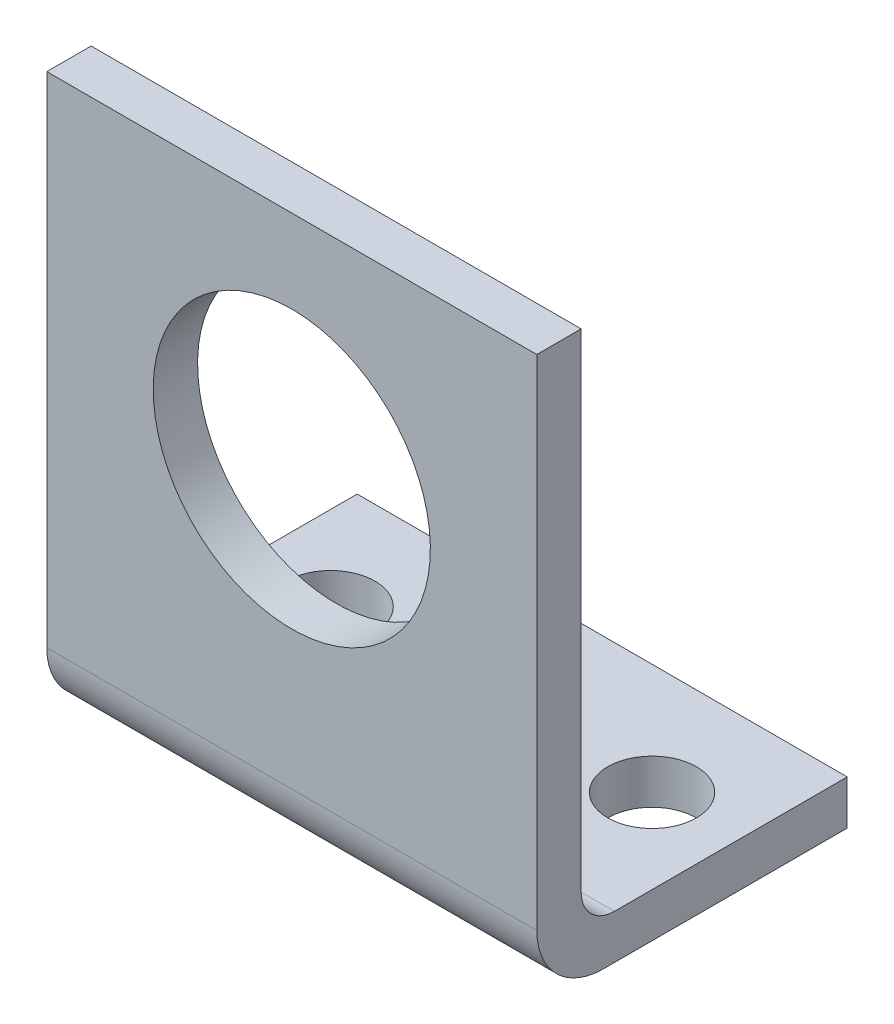
ISO-10303-21;
HEADER;
FILE_DESCRIPTION(('STEP AP214'),'2;1');
FILE_NAME('part.step','',(''),(''),'','','');
FILE_SCHEMA(('AUTOMOTIVE_DESIGN { 1 0 10303 214 1 1 1 1 }'));
ENDSEC;
DATA;
#1=APPLICATION_CONTEXT('core data for automotive mechanical design processes');
#2=APPLICATION_PROTOCOL_DEFINITION('international standard','automotive_design',2000,#1);
#3=PRODUCT_CONTEXT('',#1,'mechanical');
#4=PRODUCT('Part','Part','',(#3));
#5=PRODUCT_RELATED_PRODUCT_CATEGORY('part','',(#4));
#6=PRODUCT_DEFINITION_FORMATION('','',#4);
#7=PRODUCT_DEFINITION_CONTEXT('part definition',#1,'design');
#8=PRODUCT_DEFINITION('design','',#6,#7);
#9=PRODUCT_DEFINITION_SHAPE('','',#8);
#10=(LENGTH_UNIT() NAMED_UNIT(*) SI_UNIT(.MILLI.,.METRE.));
#11=(NAMED_UNIT(*) PLANE_ANGLE_UNIT() SI_UNIT($,.RADIAN.));
#12=(NAMED_UNIT(*) SI_UNIT($,.STERADIAN.) SOLID_ANGLE_UNIT());
#13=UNCERTAINTY_MEASURE_WITH_UNIT(LENGTH_MEASURE(1.E-05),#10,'distance_accuracy_value','');
#14=(GEOMETRIC_REPRESENTATION_CONTEXT(3) GLOBAL_UNCERTAINTY_ASSIGNED_CONTEXT((#13)) GLOBAL_UNIT_ASSIGNED_CONTEXT((#10,
#11,#12)) REPRESENTATION_CONTEXT('',''));
#15=CARTESIAN_POINT('',(0.,0.,0.));
#16=DIRECTION('',(0.,0.,1.));
#17=DIRECTION('',(1.,0.,0.));
#18=AXIS2_PLACEMENT_3D('',#15,#16,#17);
#19=CARTESIAN_POINT('',(22.1,25.5,0.));
#20=DIRECTION('',(0.,-1.,0.));
#21=DIRECTION('',(0.,0.,-1.));
#22=AXIS2_PLACEMENT_3D('',#19,#20,#21);
#23=PLANE('',#22);
#24=DIRECTION('',(0.,0.,1.));
#25=VECTOR('',#24,1.);
#26=CARTESIAN_POINT('',(0.,25.5,0.));
#27=LINE('',#26,#25);
#28=CARTESIAN_POINT('',(0.,25.5,-2.));
#29=VERTEX_POINT('',#28);
#30=CARTESIAN_POINT('',(0.,25.5,0.));
#31=VERTEX_POINT('',#30);
#32=EDGE_CURVE('E129',#29,#31,#27,.T.);
#33=ORIENTED_EDGE('',*,*,#32,.T.);
#34=DIRECTION('',(-1.,0.,0.));
#35=VECTOR('',#34,1.);
#36=CARTESIAN_POINT('',(22.1,25.5,0.));
#37=LINE('',#36,#35);
#38=CARTESIAN_POINT('',(22.1,25.5,0.));
#39=VERTEX_POINT('',#38);
#40=EDGE_CURVE('E11',#39,#31,#37,.T.);
#41=ORIENTED_EDGE('',*,*,#40,.F.);
#42=DIRECTION('',(0.,0.,1.));
#43=VECTOR('',#42,1.);
#44=CARTESIAN_POINT('',(22.1,25.5,0.));
#45=LINE('',#44,#43);
#46=CARTESIAN_POINT('',(22.1,25.5,-2.));
#47=VERTEX_POINT('',#46);
#48=EDGE_CURVE('E144',#47,#39,#45,.T.);
#49=ORIENTED_EDGE('',*,*,#48,.F.);
#50=DIRECTION('',(-1.,0.,0.));
#51=VECTOR('',#50,1.);
#52=CARTESIAN_POINT('',(22.1,25.5,-2.));
#53=LINE('',#52,#51);
#54=EDGE_CURVE('E125',#47,#29,#53,.T.);
#55=ORIENTED_EDGE('',*,*,#54,.T.);
#56=EDGE_LOOP('',(#33,#41,#49,#55));
#57=FACE_BOUND('',#56,.T.);
#58=ADVANCED_FACE('F33',(#57),#23,.F.);
#59=CARTESIAN_POINT('',(22.1,25.5,0.));
#60=DIRECTION('',(0.,0.,-1.));
#61=DIRECTION('',(0.,1.,0.));
#62=AXIS2_PLACEMENT_3D('',#59,#60,#61);
#63=PLANE('',#62);
#64=CARTESIAN_POINT('',(11.05,15.5,0.));
#65=DIRECTION('',(0.,0.,-1.));
#66=DIRECTION('',(0.,1.,0.));
#67=AXIS2_PLACEMENT_3D('',#64,#65,#66);
#68=CIRCLE('',#67,6.25);
#69=CARTESIAN_POINT('',(11.05,21.75,0.));
#70=VERTEX_POINT('',#69);
#71=EDGE_CURVE('E186',#70,#70,#68,.T.);
#72=ORIENTED_EDGE('',*,*,#71,.T.);
#73=EDGE_LOOP('',(#72));
#74=FACE_BOUND('',#73,.T.);
#75=DIRECTION('',(0.,-1.,0.));
#76=VECTOR('',#75,1.);
#77=CARTESIAN_POINT('',(0.,25.5,0.));
#78=LINE('',#77,#76);
#79=CARTESIAN_POINT('',(0.,3.,0.));
#80=VERTEX_POINT('',#79);
#81=EDGE_CURVE('E132',#31,#80,#78,.T.);
#82=ORIENTED_EDGE('',*,*,#81,.T.);
#83=DIRECTION('',(-1.,0.,0.));
#84=VECTOR('',#83,1.);
#85=CARTESIAN_POINT('',(22.1,3.,0.));
#86=LINE('',#85,#84);
#87=CARTESIAN_POINT('',(22.1,3.,0.));
#88=VERTEX_POINT('',#87);
#89=EDGE_CURVE('E41',#88,#80,#86,.T.);
#90=ORIENTED_EDGE('',*,*,#89,.F.);
#91=DIRECTION('',(0.,-1.,0.));
#92=VECTOR('',#91,1.);
#93=CARTESIAN_POINT('',(22.1,25.5,0.));
#94=LINE('',#93,#92);
#95=EDGE_CURVE('E92',#39,#88,#94,.T.);
#96=ORIENTED_EDGE('',*,*,#95,.F.);
#97=ORIENTED_EDGE('',*,*,#40,.T.);
#98=EDGE_LOOP('',(#82,#90,#96,#97));
#99=FACE_BOUND('',#98,.T.);
#100=ADVANCED_FACE('F195',(#74,#99),#63,.F.);
#101=CARTESIAN_POINT('',(22.1,3.,-3.));
#102=DIRECTION('',(-1.,0.,0.));
#103=DIRECTION('',(0.,0.,1.));
#104=AXIS2_PLACEMENT_3D('',#101,#102,#103);
#105=CYLINDRICAL_SURFACE('',#104,3.);
#106=CARTESIAN_POINT('',(0.,3.,-3.));
#107=DIRECTION('',(1.,0.,0.));
#108=DIRECTION('',(0.,0.,-1.));
#109=AXIS2_PLACEMENT_3D('',#106,#107,#108);
#110=CIRCLE('',#109,3.);
#111=CARTESIAN_POINT('',(0.,0.,-3.));
#112=VERTEX_POINT('',#111);
#113=EDGE_CURVE('E135',#80,#112,#110,.T.);
#114=ORIENTED_EDGE('',*,*,#113,.T.);
#115=DIRECTION('',(-1.,0.,0.));
#116=VECTOR('',#115,1.);
#117=CARTESIAN_POINT('',(22.1,0.,-3.));
#118=LINE('',#117,#116);
#119=CARTESIAN_POINT('',(22.1,0.,-3.));
#120=VERTEX_POINT('',#119);
#121=EDGE_CURVE('E151',#120,#112,#118,.T.);
#122=ORIENTED_EDGE('',*,*,#121,.F.);
#123=CARTESIAN_POINT('',(22.1,3.,-3.));
#124=DIRECTION('',(1.,0.,0.));
#125=DIRECTION('',(0.,0.,-1.));
#126=AXIS2_PLACEMENT_3D('',#123,#124,#125);
#127=CIRCLE('',#126,3.);
#128=EDGE_CURVE('E159',#88,#120,#127,.T.);
#129=ORIENTED_EDGE('',*,*,#128,.F.);
#130=ORIENTED_EDGE('',*,*,#89,.T.);
#131=EDGE_LOOP('',(#114,#122,#129,#130));
#132=FACE_BOUND('',#131,.T.);
#133=ADVANCED_FACE('F157',(#132),#105,.T.);
#134=CARTESIAN_POINT('',(22.1,0.,-3.));
#135=DIRECTION('',(0.,1.,0.));
#136=DIRECTION('',(0.,0.,1.));
#137=AXIS2_PLACEMENT_3D('',#134,#135,#136);
#138=PLANE('',#137);
#139=CARTESIAN_POINT('',(18.3,0.,-9.));
#140=DIRECTION('',(0.,1.,0.));
#141=DIRECTION('',(0.,0.,1.));
#142=AXIS2_PLACEMENT_3D('',#139,#140,#141);
#143=CIRCLE('',#142,2.);
#144=CARTESIAN_POINT('',(18.3,0.,-7.));
#145=VERTEX_POINT('',#144);
#146=EDGE_CURVE('E180',#145,#145,#143,.T.);
#147=ORIENTED_EDGE('',*,*,#146,.T.);
#148=EDGE_LOOP('',(#147));
#149=FACE_BOUND('',#148,.T.);
#150=CARTESIAN_POINT('',(3.8,0.,-9.));
#151=DIRECTION('',(0.,1.,0.));
#152=DIRECTION('',(0.,0.,1.));
#153=AXIS2_PLACEMENT_3D('',#150,#151,#152);
#154=CIRCLE('',#153,2.);
#155=CARTESIAN_POINT('',(3.8,0.,-7.));
#156=VERTEX_POINT('',#155);
#157=EDGE_CURVE('E133',#156,#156,#154,.T.);
#158=ORIENTED_EDGE('',*,*,#157,.T.);
#159=EDGE_LOOP('',(#158));
#160=FACE_BOUND('',#159,.T.);
#161=DIRECTION('',(0.,0.,-1.));
#162=VECTOR('',#161,1.);
#163=CARTESIAN_POINT('',(0.,0.,-3.));
#164=LINE('',#163,#162);
#165=CARTESIAN_POINT('',(0.,0.,-14.));
#166=VERTEX_POINT('',#165);
#167=EDGE_CURVE('E137',#112,#166,#164,.T.);
#168=ORIENTED_EDGE('',*,*,#167,.T.);
#169=DIRECTION('',(-1.,0.,0.));
#170=VECTOR('',#169,1.);
#171=CARTESIAN_POINT('',(22.1,0.,-14.));
#172=LINE('',#171,#170);
#173=CARTESIAN_POINT('',(22.1,0.,-14.));
#174=VERTEX_POINT('',#173);
#175=EDGE_CURVE('E148',#174,#166,#172,.T.);
#176=ORIENTED_EDGE('',*,*,#175,.F.);
#177=DIRECTION('',(0.,0.,-1.));
#178=VECTOR('',#177,1.);
#179=CARTESIAN_POINT('',(22.1,0.,-3.));
#180=LINE('',#179,#178);
#181=EDGE_CURVE('E171',#120,#174,#180,.T.);
#182=ORIENTED_EDGE('',*,*,#181,.F.);
#183=ORIENTED_EDGE('',*,*,#121,.T.);
#184=EDGE_LOOP('',(#168,#176,#182,#183));
#185=FACE_BOUND('',#184,.T.);
#186=ADVANCED_FACE('F167',(#149,#160,#185),#138,.F.);
#187=CARTESIAN_POINT('',(22.1,2.,-14.));
#188=DIRECTION('',(0.,0.,1.));
#189=DIRECTION('',(1.,0.,0.));
#190=AXIS2_PLACEMENT_3D('',#187,#188,#189);
#191=PLANE('',#190);
#192=DIRECTION('',(0.,1.,0.));
#193=VECTOR('',#192,1.);
#194=CARTESIAN_POINT('',(0.,2.,-14.));
#195=LINE('',#194,#193);
#196=CARTESIAN_POINT('',(0.,2.,-14.));
#197=VERTEX_POINT('',#196);
#198=EDGE_CURVE('E139',#166,#197,#195,.T.);
#199=ORIENTED_EDGE('',*,*,#198,.T.);
#200=DIRECTION('',(-1.,0.,0.));
#201=VECTOR('',#200,1.);
#202=CARTESIAN_POINT('',(22.1,2.,-14.));
#203=LINE('',#202,#201);
#204=CARTESIAN_POINT('',(22.1,2.,-14.));
#205=VERTEX_POINT('',#204);
#206=EDGE_CURVE('E120',#205,#197,#203,.T.);
#207=ORIENTED_EDGE('',*,*,#206,.F.);
#208=DIRECTION('',(0.,1.,0.));
#209=VECTOR('',#208,1.);
#210=CARTESIAN_POINT('',(22.1,2.,-14.));
#211=LINE('',#210,#209);
#212=EDGE_CURVE('E111',#174,#205,#211,.T.);
#213=ORIENTED_EDGE('',*,*,#212,.F.);
#214=ORIENTED_EDGE('',*,*,#175,.T.);
#215=EDGE_LOOP('',(#199,#207,#213,#214));
#216=FACE_BOUND('',#215,.T.);
#217=ADVANCED_FACE('F170',(#216),#191,.F.);
#218=CARTESIAN_POINT('',(22.1,2.,-3.50000000000001));
#219=DIRECTION('',(0.,-1.,0.));
#220=DIRECTION('',(0.,0.,-1.));
#221=AXIS2_PLACEMENT_3D('',#218,#219,#220);
#222=PLANE('',#221);
#223=CARTESIAN_POINT('',(18.3,2.,-9.));
#224=DIRECTION('',(0.,1.,0.));
#225=DIRECTION('',(0.,0.,1.));
#226=AXIS2_PLACEMENT_3D('',#223,#224,#225);
#227=CIRCLE('',#226,2.);
#228=CARTESIAN_POINT('',(18.3,2.,-7.));
#229=VERTEX_POINT('',#228);
#230=EDGE_CURVE('E183',#229,#229,#227,.T.);
#231=ORIENTED_EDGE('',*,*,#230,.F.);
#232=EDGE_LOOP('',(#231));
#233=FACE_BOUND('',#232,.T.);
#234=CARTESIAN_POINT('',(3.8,2.,-9.));
#235=DIRECTION('',(0.,1.,0.));
#236=DIRECTION('',(0.,0.,1.));
#237=AXIS2_PLACEMENT_3D('',#234,#235,#236);
#238=CIRCLE('',#237,2.);
#239=CARTESIAN_POINT('',(3.8,2.,-7.));
#240=VERTEX_POINT('',#239);
#241=EDGE_CURVE('E177',#240,#240,#238,.T.);
#242=ORIENTED_EDGE('',*,*,#241,.F.);
#243=EDGE_LOOP('',(#242));
#244=FACE_BOUND('',#243,.T.);
#245=DIRECTION('',(0.,0.,1.));
#246=VECTOR('',#245,1.);
#247=CARTESIAN_POINT('',(0.,2.,-3.50000000000001));
#248=LINE('',#247,#246);
#249=CARTESIAN_POINT('',(0.,2.,-3.50000000000001));
#250=VERTEX_POINT('',#249);
#251=EDGE_CURVE('E119',#197,#250,#248,.T.);
#252=ORIENTED_EDGE('',*,*,#251,.T.);
#253=DIRECTION('',(-1.,0.,0.));
#254=VECTOR('',#253,1.);
#255=CARTESIAN_POINT('',(22.1,2.,-3.50000000000001));
#256=LINE('',#255,#254);
#257=CARTESIAN_POINT('',(22.1,2.,-3.50000000000001));
#258=VERTEX_POINT('',#257);
#259=EDGE_CURVE('E116',#258,#250,#256,.T.);
#260=ORIENTED_EDGE('',*,*,#259,.F.);
#261=DIRECTION('',(0.,0.,1.));
#262=VECTOR('',#261,1.);
#263=CARTESIAN_POINT('',(22.1,2.,-3.50000000000001));
#264=LINE('',#263,#262);
#265=EDGE_CURVE('E105',#205,#258,#264,.T.);
#266=ORIENTED_EDGE('',*,*,#265,.F.);
#267=ORIENTED_EDGE('',*,*,#206,.T.);
#268=EDGE_LOOP('',(#252,#260,#266,#267));
#269=FACE_BOUND('',#268,.T.);
#270=ADVANCED_FACE('F117',(#233,#244,#269),#222,.F.);
#271=CARTESIAN_POINT('',(22.1,3.5,-3.5));
#272=DIRECTION('',(-1.,0.,0.));
#273=DIRECTION('',(0.,0.,1.));
#274=AXIS2_PLACEMENT_3D('',#271,#272,#273);
#275=CYLINDRICAL_SURFACE('',#274,1.5);
#276=CARTESIAN_POINT('',(0.,3.5,-3.5));
#277=DIRECTION('',(-1.,0.,0.));
#278=DIRECTION('',(0.,0.,-1.));
#279=AXIS2_PLACEMENT_3D('',#276,#277,#278);
#280=CIRCLE('',#279,1.5);
#281=CARTESIAN_POINT('',(0.,3.50000000000001,-2.));
#282=VERTEX_POINT('',#281);
#283=EDGE_CURVE('E78',#250,#282,#280,.T.);
#284=ORIENTED_EDGE('',*,*,#283,.T.);
#285=DIRECTION('',(-1.,0.,0.));
#286=VECTOR('',#285,1.);
#287=CARTESIAN_POINT('',(22.1,3.50000000000001,-2.));
#288=LINE('',#287,#286);
#289=CARTESIAN_POINT('',(22.1,3.50000000000001,-2.));
#290=VERTEX_POINT('',#289);
#291=EDGE_CURVE('E121',#290,#282,#288,.T.);
#292=ORIENTED_EDGE('',*,*,#291,.F.);
#293=CARTESIAN_POINT('',(22.1,3.5,-3.5));
#294=DIRECTION('',(-1.,0.,0.));
#295=DIRECTION('',(0.,0.,-1.));
#296=AXIS2_PLACEMENT_3D('',#293,#294,#295);
#297=CIRCLE('',#296,1.5);
#298=EDGE_CURVE('E109',#258,#290,#297,.T.);
#299=ORIENTED_EDGE('',*,*,#298,.F.);
#300=ORIENTED_EDGE('',*,*,#259,.T.);
#301=EDGE_LOOP('',(#284,#292,#299,#300));
#302=FACE_BOUND('',#301,.T.);
#303=ADVANCED_FACE('F123',(#302),#275,.F.);
#304=CARTESIAN_POINT('',(22.1,25.5,-2.));
#305=DIRECTION('',(0.,0.,1.));
#306=DIRECTION('',(0.,-1.,0.));
#307=AXIS2_PLACEMENT_3D('',#304,#305,#306);
#308=PLANE('',#307);
#309=CARTESIAN_POINT('',(11.05,15.5,-2.));
#310=DIRECTION('',(0.,0.,-1.));
#311=DIRECTION('',(0.,1.,0.));
#312=AXIS2_PLACEMENT_3D('',#309,#310,#311);
#313=CIRCLE('',#312,6.25);
#314=CARTESIAN_POINT('',(11.05,21.75,-2.));
#315=VERTEX_POINT('',#314);
#316=EDGE_CURVE('E189',#315,#315,#313,.T.);
#317=ORIENTED_EDGE('',*,*,#316,.F.);
#318=EDGE_LOOP('',(#317));
#319=FACE_BOUND('',#318,.T.);
#320=DIRECTION('',(0.,1.,0.));
#321=VECTOR('',#320,1.);
#322=CARTESIAN_POINT('',(0.,25.5,-2.));
#323=LINE('',#322,#321);
#324=EDGE_CURVE('E84',#282,#29,#323,.T.);
#325=ORIENTED_EDGE('',*,*,#324,.T.);
#326=ORIENTED_EDGE('',*,*,#54,.F.);
#327=DIRECTION('',(0.,1.,0.));
#328=VECTOR('',#327,1.);
#329=CARTESIAN_POINT('',(22.1,25.5,-2.));
#330=LINE('',#329,#328);
#331=EDGE_CURVE('E49',#290,#47,#330,.T.);
#332=ORIENTED_EDGE('',*,*,#331,.F.);
#333=ORIENTED_EDGE('',*,*,#291,.T.);
#334=EDGE_LOOP('',(#325,#326,#332,#333));
#335=FACE_BOUND('',#334,.T.);
#336=ADVANCED_FACE('F204',(#319,#335),#308,.F.);
#337=CARTESIAN_POINT('',(22.1,3.5,-3.5));
#338=DIRECTION('',(1.,0.,0.));
#339=DIRECTION('',(0.,0.,-1.));
#340=AXIS2_PLACEMENT_3D('',#337,#338,#339);
#341=PLANE('',#340);
#342=ORIENTED_EDGE('',*,*,#48,.T.);
#343=ORIENTED_EDGE('',*,*,#95,.T.);
#344=ORIENTED_EDGE('',*,*,#128,.T.);
#345=ORIENTED_EDGE('',*,*,#181,.T.);
#346=ORIENTED_EDGE('',*,*,#212,.T.);
#347=ORIENTED_EDGE('',*,*,#265,.T.);
#348=ORIENTED_EDGE('',*,*,#298,.T.);
#349=ORIENTED_EDGE('',*,*,#331,.T.);
#350=EDGE_LOOP('',(#342,#343,#344,#345,#346,#347,#348,#349));
#351=FACE_BOUND('',#350,.T.);
#352=ADVANCED_FACE('F107',(#351),#341,.T.);
#353=CARTESIAN_POINT('',(0.,3.5,-3.5));
#354=DIRECTION('',(1.,0.,0.));
#355=DIRECTION('',(0.,0.,-1.));
#356=AXIS2_PLACEMENT_3D('',#353,#354,#355);
#357=PLANE('',#356);
#358=ORIENTED_EDGE('',*,*,#32,.F.);
#359=ORIENTED_EDGE('',*,*,#324,.F.);
#360=ORIENTED_EDGE('',*,*,#283,.F.);
#361=ORIENTED_EDGE('',*,*,#251,.F.);
#362=ORIENTED_EDGE('',*,*,#198,.F.);
#363=ORIENTED_EDGE('',*,*,#167,.F.);
#364=ORIENTED_EDGE('',*,*,#113,.F.);
#365=ORIENTED_EDGE('',*,*,#81,.F.);
#366=EDGE_LOOP('',(#358,#359,#360,#361,#362,#363,#364,#365));
#367=FACE_BOUND('',#366,.T.);
#368=ADVANCED_FACE('F163',(#367),#357,.F.);
#369=CARTESIAN_POINT('',(3.8,0.,-9.));
#370=DIRECTION('',(0.,1.,0.));
#371=DIRECTION('',(0.,0.,1.));
#372=AXIS2_PLACEMENT_3D('',#369,#370,#371);
#373=CYLINDRICAL_SURFACE('',#372,2.);
#374=ORIENTED_EDGE('',*,*,#157,.F.);
#375=EDGE_LOOP('',(#374));
#376=FACE_BOUND('',#375,.T.);
#377=ORIENTED_EDGE('',*,*,#241,.T.);
#378=EDGE_LOOP('',(#377));
#379=FACE_BOUND('',#378,.T.);
#380=ADVANCED_FACE('F239',(#376,#379),#373,.F.);
#381=CARTESIAN_POINT('',(18.3,0.,-9.));
#382=DIRECTION('',(0.,1.,0.));
#383=DIRECTION('',(0.,0.,1.));
#384=AXIS2_PLACEMENT_3D('',#381,#382,#383);
#385=CYLINDRICAL_SURFACE('',#384,2.);
#386=ORIENTED_EDGE('',*,*,#146,.F.);
#387=EDGE_LOOP('',(#386));
#388=FACE_BOUND('',#387,.T.);
#389=ORIENTED_EDGE('',*,*,#230,.T.);
#390=EDGE_LOOP('',(#389));
#391=FACE_BOUND('',#390,.T.);
#392=ADVANCED_FACE('F200',(#388,#391),#385,.F.);
#393=CARTESIAN_POINT('',(11.05,15.5,0.));
#394=DIRECTION('',(0.,0.,-1.));
#395=DIRECTION('',(0.,1.,0.));
#396=AXIS2_PLACEMENT_3D('',#393,#394,#395);
#397=CYLINDRICAL_SURFACE('',#396,6.25);
#398=ORIENTED_EDGE('',*,*,#71,.F.);
#399=EDGE_LOOP('',(#398));
#400=FACE_BOUND('',#399,.T.);
#401=ORIENTED_EDGE('',*,*,#316,.T.);
#402=EDGE_LOOP('',(#401));
#403=FACE_BOUND('',#402,.T.);
#404=ADVANCED_FACE('F197',(#400,#403),#397,.F.);
#405=CLOSED_SHELL('',(#58,#100,#133,#186,#217,#270,#303,#336,#352,#368,#380,#392,#404));
#406=MANIFOLD_SOLID_BREP('B2',#405);
#407=ADVANCED_BREP_SHAPE_REPRESENTATION('',(#18,#406),#14);
#408=SHAPE_DEFINITION_REPRESENTATION(#9,#407);
ENDSEC;
END-ISO-10303-21;
